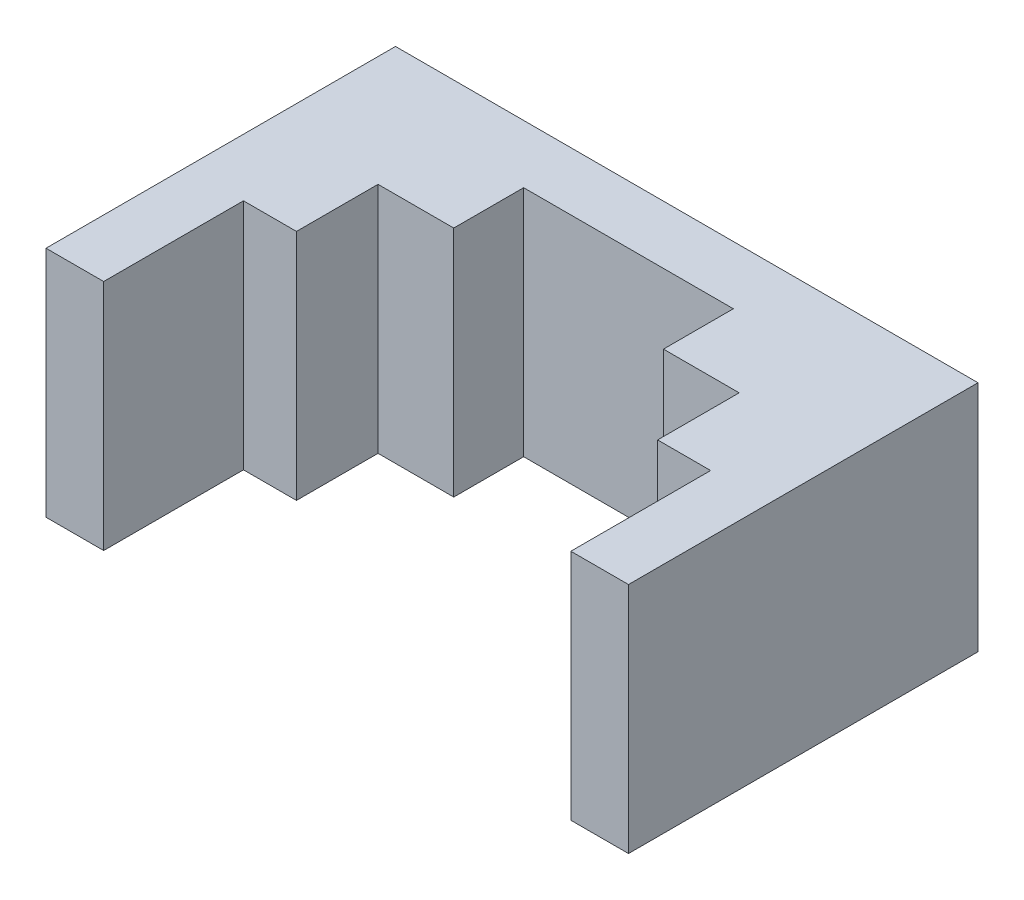
ISO-10303-21;
HEADER;
FILE_DESCRIPTION(('STEP AP214'),'2;1');
FILE_NAME('part.step','',(''),(''),'','','');
FILE_SCHEMA(('AUTOMOTIVE_DESIGN { 1 0 10303 214 1 1 1 1 }'));
ENDSEC;
DATA;
#1=APPLICATION_CONTEXT('core data for automotive mechanical design processes');
#2=APPLICATION_PROTOCOL_DEFINITION('international standard','automotive_design',2000,#1);
#3=PRODUCT_CONTEXT('',#1,'mechanical');
#4=PRODUCT('Part','Part','',(#3));
#5=PRODUCT_RELATED_PRODUCT_CATEGORY('part','',(#4));
#6=PRODUCT_DEFINITION_FORMATION('','',#4);
#7=PRODUCT_DEFINITION_CONTEXT('part definition',#1,'design');
#8=PRODUCT_DEFINITION('design','',#6,#7);
#9=PRODUCT_DEFINITION_SHAPE('','',#8);
#10=(LENGTH_UNIT() NAMED_UNIT(*) SI_UNIT(.MILLI.,.METRE.));
#11=(NAMED_UNIT(*) PLANE_ANGLE_UNIT() SI_UNIT($,.RADIAN.));
#12=(NAMED_UNIT(*) SI_UNIT($,.STERADIAN.) SOLID_ANGLE_UNIT());
#13=UNCERTAINTY_MEASURE_WITH_UNIT(LENGTH_MEASURE(1.E-05),#10,'distance_accuracy_value','');
#14=(GEOMETRIC_REPRESENTATION_CONTEXT(3) GLOBAL_UNCERTAINTY_ASSIGNED_CONTEXT((#13)) GLOBAL_UNIT_ASSIGNED_CONTEXT((#10,
#11,#12)) REPRESENTATION_CONTEXT('',''));
#15=CARTESIAN_POINT('',(0.,0.,0.));
#16=DIRECTION('',(0.,0.,1.));
#17=DIRECTION('',(1.,0.,0.));
#18=AXIS2_PLACEMENT_3D('',#15,#16,#17);
#19=CARTESIAN_POINT('',(4.5,5.,2.5));
#20=DIRECTION('',(1.,0.,0.));
#21=DIRECTION('',(0.,0.,-1.));
#22=AXIS2_PLACEMENT_3D('',#19,#20,#21);
#23=PLANE('',#22);
#24=DIRECTION('',(0.,-1.,0.));
#25=VECTOR('',#24,1.);
#26=CARTESIAN_POINT('',(4.5,5.,5.5));
#27=LINE('',#26,#25);
#28=CARTESIAN_POINT('',(4.5,5.,5.5));
#29=VERTEX_POINT('',#28);
#30=CARTESIAN_POINT('',(4.5,-5.,5.5));
#31=VERTEX_POINT('',#30);
#32=EDGE_CURVE('E177',#29,#31,#27,.T.);
#33=ORIENTED_EDGE('',*,*,#32,.F.);
#34=DIRECTION('',(0.,0.,1.));
#35=VECTOR('',#34,1.);
#36=CARTESIAN_POINT('',(4.5,5.,2.5));
#37=LINE('',#36,#35);
#38=CARTESIAN_POINT('',(4.5,5.,2.5));
#39=VERTEX_POINT('',#38);
#40=EDGE_CURVE('E167',#39,#29,#37,.T.);
#41=ORIENTED_EDGE('',*,*,#40,.F.);
#42=DIRECTION('',(0.,1.,0.));
#43=VECTOR('',#42,1.);
#44=CARTESIAN_POINT('',(4.5,5.,2.5));
#45=LINE('',#44,#43);
#46=CARTESIAN_POINT('',(4.5,-5.,2.5));
#47=VERTEX_POINT('',#46);
#48=EDGE_CURVE('E183',#47,#39,#45,.T.);
#49=ORIENTED_EDGE('',*,*,#48,.F.);
#50=DIRECTION('',(0.,0.,1.));
#51=VECTOR('',#50,1.);
#52=CARTESIAN_POINT('',(4.5,-5.,2.5));
#53=LINE('',#52,#51);
#54=EDGE_CURVE('E195',#47,#31,#53,.T.);
#55=ORIENTED_EDGE('',*,*,#54,.T.);
#56=EDGE_LOOP('',(#33,#41,#49,#55));
#57=FACE_BOUND('',#56,.T.);
#58=ADVANCED_FACE('F33',(#57),#23,.F.);
#59=CARTESIAN_POINT('',(-4.5,5.,2.5));
#60=DIRECTION('',(-1.,0.,0.));
#61=DIRECTION('',(0.,0.,1.));
#62=AXIS2_PLACEMENT_3D('',#59,#60,#61);
#63=PLANE('',#62);
#64=DIRECTION('',(0.,1.,0.));
#65=VECTOR('',#64,1.);
#66=CARTESIAN_POINT('',(-4.5,5.,5.5));
#67=LINE('',#66,#65);
#68=CARTESIAN_POINT('',(-4.5,-5.,5.5));
#69=VERTEX_POINT('',#68);
#70=CARTESIAN_POINT('',(-4.5,5.,5.5));
#71=VERTEX_POINT('',#70);
#72=EDGE_CURVE('E11',#69,#71,#67,.T.);
#73=ORIENTED_EDGE('',*,*,#72,.F.);
#74=DIRECTION('',(0.,0.,1.));
#75=VECTOR('',#74,1.);
#76=CARTESIAN_POINT('',(-4.5,-5.,2.5));
#77=LINE('',#76,#75);
#78=CARTESIAN_POINT('',(-4.5,-5.,2.5));
#79=VERTEX_POINT('',#78);
#80=EDGE_CURVE('E199',#79,#69,#77,.T.);
#81=ORIENTED_EDGE('',*,*,#80,.F.);
#82=DIRECTION('',(0.,-1.,0.));
#83=VECTOR('',#82,1.);
#84=CARTESIAN_POINT('',(-4.5,5.,2.5));
#85=LINE('',#84,#83);
#86=CARTESIAN_POINT('',(-4.5,5.,2.5));
#87=VERTEX_POINT('',#86);
#88=EDGE_CURVE('E189',#87,#79,#85,.T.);
#89=ORIENTED_EDGE('',*,*,#88,.F.);
#90=DIRECTION('',(0.,0.,1.));
#91=VECTOR('',#90,1.);
#92=CARTESIAN_POINT('',(-4.5,5.,2.5));
#93=LINE('',#92,#91);
#94=EDGE_CURVE('E202',#87,#71,#93,.T.);
#95=ORIENTED_EDGE('',*,*,#94,.T.);
#96=EDGE_LOOP('',(#73,#81,#89,#95));
#97=FACE_BOUND('',#96,.T.);
#98=ADVANCED_FACE('F301',(#97),#63,.F.);
#99=CARTESIAN_POINT('',(0.,0.,9.));
#100=DIRECTION('',(0.,0.,1.));
#101=DIRECTION('',(1.,0.,0.));
#102=AXIS2_PLACEMENT_3D('',#99,#100,#101);
#103=PLANE('',#102);
#104=DIRECTION('',(0.,1.,0.));
#105=VECTOR('',#104,1.);
#106=CARTESIAN_POINT('',(7.75,5.,9.));
#107=LINE('',#106,#105);
#108=CARTESIAN_POINT('',(7.75,-5.,9.));
#109=VERTEX_POINT('',#108);
#110=CARTESIAN_POINT('',(7.75,5.,9.));
#111=VERTEX_POINT('',#110);
#112=EDGE_CURVE('E152',#109,#111,#107,.T.);
#113=ORIENTED_EDGE('',*,*,#112,.F.);
#114=DIRECTION('',(1.,0.,0.));
#115=VECTOR('',#114,1.);
#116=CARTESIAN_POINT('',(-10.025,-5.,9.));
#117=LINE('',#116,#115);
#118=CARTESIAN_POINT('',(10.025,-5.,9.));
#119=VERTEX_POINT('',#118);
#120=EDGE_CURVE('E216',#109,#119,#117,.T.);
#121=ORIENTED_EDGE('',*,*,#120,.T.);
#122=DIRECTION('',(0.,1.,0.));
#123=VECTOR('',#122,1.);
#124=CARTESIAN_POINT('',(10.025,5.,9.));
#125=LINE('',#124,#123);
#126=CARTESIAN_POINT('',(10.025,5.,9.));
#127=VERTEX_POINT('',#126);
#128=EDGE_CURVE('E206',#119,#127,#125,.T.);
#129=ORIENTED_EDGE('',*,*,#128,.T.);
#130=DIRECTION('',(-1.,0.,0.));
#131=VECTOR('',#130,1.);
#132=CARTESIAN_POINT('',(-10.025,5.,9.));
#133=LINE('',#132,#131);
#134=EDGE_CURVE('E211',#127,#111,#133,.T.);
#135=ORIENTED_EDGE('',*,*,#134,.T.);
#136=EDGE_LOOP('',(#113,#121,#129,#135));
#137=FACE_BOUND('',#136,.T.);
#138=ADVANCED_FACE('F310',(#137),#103,.T.);
#139=CARTESIAN_POINT('',(0.,0.,15.));
#140=DIRECTION('',(0.,0.,1.));
#141=DIRECTION('',(1.,0.,0.));
#142=AXIS2_PLACEMENT_3D('',#139,#140,#141);
#143=PLANE('',#142);
#144=DIRECTION('',(0.,1.,0.));
#145=VECTOR('',#144,1.);
#146=CARTESIAN_POINT('',(10.025,5.,15.));
#147=LINE('',#146,#145);
#148=CARTESIAN_POINT('',(10.025,-5.,15.));
#149=VERTEX_POINT('',#148);
#150=CARTESIAN_POINT('',(10.025,5.,15.));
#151=VERTEX_POINT('',#150);
#152=EDGE_CURVE('E198',#149,#151,#147,.T.);
#153=ORIENTED_EDGE('',*,*,#152,.F.);
#154=DIRECTION('',(1.,0.,0.));
#155=VECTOR('',#154,1.);
#156=CARTESIAN_POINT('',(-12.5,-5.,15.));
#157=LINE('',#156,#155);
#158=CARTESIAN_POINT('',(12.5,-5.,15.));
#159=VERTEX_POINT('',#158);
#160=EDGE_CURVE('E243',#149,#159,#157,.T.);
#161=ORIENTED_EDGE('',*,*,#160,.T.);
#162=DIRECTION('',(0.,1.,0.));
#163=VECTOR('',#162,1.);
#164=CARTESIAN_POINT('',(12.5,5.,15.));
#165=LINE('',#164,#163);
#166=CARTESIAN_POINT('',(12.5,5.,15.));
#167=VERTEX_POINT('',#166);
#168=EDGE_CURVE('E233',#159,#167,#165,.T.);
#169=ORIENTED_EDGE('',*,*,#168,.T.);
#170=DIRECTION('',(-1.,0.,0.));
#171=VECTOR('',#170,1.);
#172=CARTESIAN_POINT('',(-12.5,5.,15.));
#173=LINE('',#172,#171);
#174=EDGE_CURVE('E238',#167,#151,#173,.T.);
#175=ORIENTED_EDGE('',*,*,#174,.T.);
#176=EDGE_LOOP('',(#153,#161,#169,#175));
#177=FACE_BOUND('',#176,.T.);
#178=ADVANCED_FACE('F315',(#177),#143,.T.);
#179=CARTESIAN_POINT('',(12.5,5.,15.));
#180=DIRECTION('',(-1.,0.,0.));
#181=DIRECTION('',(0.,-1.,0.));
#182=AXIS2_PLACEMENT_3D('',#179,#180,#181);
#183=PLANE('',#182);
#184=DIRECTION('',(0.,1.,0.));
#185=VECTOR('',#184,1.);
#186=CARTESIAN_POINT('',(12.5,5.,0.));
#187=LINE('',#186,#185);
#188=CARTESIAN_POINT('',(12.5,-5.,0.));
#189=VERTEX_POINT('',#188);
#190=CARTESIAN_POINT('',(12.5,5.,0.));
#191=VERTEX_POINT('',#190);
#192=EDGE_CURVE('E225',#189,#191,#187,.T.);
#193=ORIENTED_EDGE('',*,*,#192,.T.);
#194=DIRECTION('',(0.,0.,-1.));
#195=VECTOR('',#194,1.);
#196=CARTESIAN_POINT('',(12.5,5.,15.));
#197=LINE('',#196,#195);
#198=EDGE_CURVE('E41',#167,#191,#197,.T.);
#199=ORIENTED_EDGE('',*,*,#198,.F.);
#200=ORIENTED_EDGE('',*,*,#168,.F.);
#201=DIRECTION('',(0.,0.,-1.));
#202=VECTOR('',#201,1.);
#203=CARTESIAN_POINT('',(12.5,-5.,15.));
#204=LINE('',#203,#202);
#205=EDGE_CURVE('E247',#159,#189,#204,.T.);
#206=ORIENTED_EDGE('',*,*,#205,.T.);
#207=EDGE_LOOP('',(#193,#199,#200,#206));
#208=FACE_BOUND('',#207,.T.);
#209=ADVANCED_FACE('F35',(#208),#183,.F.);
#210=CARTESIAN_POINT('',(-12.5,5.,15.));
#211=DIRECTION('',(0.,-1.,0.));
#212=DIRECTION('',(0.,0.,-1.));
#213=AXIS2_PLACEMENT_3D('',#210,#211,#212);
#214=PLANE('',#213);
#215=DIRECTION('',(-1.,0.,0.));
#216=VECTOR('',#215,1.);
#217=CARTESIAN_POINT('',(-7.75,5.,5.5));
#218=LINE('',#217,#216);
#219=CARTESIAN_POINT('',(7.75,5.,5.5));
#220=VERTEX_POINT('',#219);
#221=EDGE_CURVE('E48',#220,#29,#218,.T.);
#222=ORIENTED_EDGE('',*,*,#221,.F.);
#223=DIRECTION('',(0.,0.,1.));
#224=VECTOR('',#223,1.);
#225=CARTESIAN_POINT('',(7.75,5.,5.5));
#226=LINE('',#225,#224);
#227=EDGE_CURVE('E147',#220,#111,#226,.T.);
#228=ORIENTED_EDGE('',*,*,#227,.T.);
#229=ORIENTED_EDGE('',*,*,#134,.F.);
#230=DIRECTION('',(0.,0.,1.));
#231=VECTOR('',#230,1.);
#232=CARTESIAN_POINT('',(10.025,5.,9.));
#233=LINE('',#232,#231);
#234=EDGE_CURVE('E220',#127,#151,#233,.T.);
#235=ORIENTED_EDGE('',*,*,#234,.T.);
#236=ORIENTED_EDGE('',*,*,#174,.F.);
#237=ORIENTED_EDGE('',*,*,#198,.T.);
#238=DIRECTION('',(-1.,0.,0.));
#239=VECTOR('',#238,1.);
#240=CARTESIAN_POINT('',(-12.5,5.,0.));
#241=LINE('',#240,#239);
#242=CARTESIAN_POINT('',(-12.5,5.,0.));
#243=VERTEX_POINT('',#242);
#244=EDGE_CURVE('E250',#191,#243,#241,.T.);
#245=ORIENTED_EDGE('',*,*,#244,.T.);
#246=DIRECTION('',(0.,0.,-1.));
#247=VECTOR('',#246,1.);
#248=CARTESIAN_POINT('',(-12.5,5.,15.));
#249=LINE('',#248,#247);
#250=CARTESIAN_POINT('',(-12.5,5.,15.));
#251=VERTEX_POINT('',#250);
#252=EDGE_CURVE('E260',#251,#243,#249,.T.);
#253=ORIENTED_EDGE('',*,*,#252,.F.);
#254=CARTESIAN_POINT('',(-10.025,5.,15.));
#255=VERTEX_POINT('',#254);
#256=EDGE_CURVE('E236',#255,#251,#173,.T.);
#257=ORIENTED_EDGE('',*,*,#256,.F.);
#258=DIRECTION('',(0.,0.,1.));
#259=VECTOR('',#258,1.);
#260=CARTESIAN_POINT('',(-10.025,5.,9.));
#261=LINE('',#260,#259);
#262=CARTESIAN_POINT('',(-10.025,5.,9.));
#263=VERTEX_POINT('',#262);
#264=EDGE_CURVE('E229',#263,#255,#261,.T.);
#265=ORIENTED_EDGE('',*,*,#264,.F.);
#266=CARTESIAN_POINT('',(-7.75,5.,9.));
#267=VERTEX_POINT('',#266);
#268=EDGE_CURVE('E209',#267,#263,#133,.T.);
#269=ORIENTED_EDGE('',*,*,#268,.F.);
#270=DIRECTION('',(0.,0.,1.));
#271=VECTOR('',#270,1.);
#272=CARTESIAN_POINT('',(-7.75,5.,5.5));
#273=LINE('',#272,#271);
#274=CARTESIAN_POINT('',(-7.75,5.,5.5));
#275=VERTEX_POINT('',#274);
#276=EDGE_CURVE('E156',#275,#267,#273,.T.);
#277=ORIENTED_EDGE('',*,*,#276,.F.);
#278=EDGE_CURVE('E161',#71,#275,#218,.T.);
#279=ORIENTED_EDGE('',*,*,#278,.F.);
#280=ORIENTED_EDGE('',*,*,#94,.F.);
#281=DIRECTION('',(-1.,0.,0.));
#282=VECTOR('',#281,1.);
#283=CARTESIAN_POINT('',(-4.5,5.,2.5));
#284=LINE('',#283,#282);
#285=EDGE_CURVE('E186',#39,#87,#284,.T.);
#286=ORIENTED_EDGE('',*,*,#285,.F.);
#287=ORIENTED_EDGE('',*,*,#40,.T.);
#288=EDGE_LOOP('',(#222,#228,#229,#235,#236,#237,#245,#253,#257,#265,#269,#277,#279,#280,#286,#287));
#289=FACE_BOUND('',#288,.T.);
#290=ADVANCED_FACE('F165',(#289),#214,.F.);
#291=CARTESIAN_POINT('',(-12.5,5.,15.));
#292=DIRECTION('',(1.,0.,0.));
#293=DIRECTION('',(0.,1.,0.));
#294=AXIS2_PLACEMENT_3D('',#291,#292,#293);
#295=PLANE('',#294);
#296=DIRECTION('',(0.,-1.,0.));
#297=VECTOR('',#296,1.);
#298=CARTESIAN_POINT('',(-12.5,5.,0.));
#299=LINE('',#298,#297);
#300=CARTESIAN_POINT('',(-12.5,-5.,0.));
#301=VERTEX_POINT('',#300);
#302=EDGE_CURVE('E252',#243,#301,#299,.T.);
#303=ORIENTED_EDGE('',*,*,#302,.T.);
#304=DIRECTION('',(0.,0.,-1.));
#305=VECTOR('',#304,1.);
#306=CARTESIAN_POINT('',(-12.5,-5.,15.));
#307=LINE('',#306,#305);
#308=CARTESIAN_POINT('',(-12.5,-5.,15.));
#309=VERTEX_POINT('',#308);
#310=EDGE_CURVE('E257',#309,#301,#307,.T.);
#311=ORIENTED_EDGE('',*,*,#310,.F.);
#312=DIRECTION('',(0.,-1.,0.));
#313=VECTOR('',#312,1.);
#314=CARTESIAN_POINT('',(-12.5,5.,15.));
#315=LINE('',#314,#313);
#316=EDGE_CURVE('E241',#251,#309,#315,.T.);
#317=ORIENTED_EDGE('',*,*,#316,.F.);
#318=ORIENTED_EDGE('',*,*,#252,.T.);
#319=EDGE_LOOP('',(#303,#311,#317,#318));
#320=FACE_BOUND('',#319,.T.);
#321=ADVANCED_FACE('F275',(#320),#295,.F.);
#322=CARTESIAN_POINT('',(-12.5,-5.,15.));
#323=DIRECTION('',(0.,1.,0.));
#324=DIRECTION('',(0.,0.,1.));
#325=AXIS2_PLACEMENT_3D('',#322,#323,#324);
#326=PLANE('',#325);
#327=DIRECTION('',(1.,0.,0.));
#328=VECTOR('',#327,1.);
#329=CARTESIAN_POINT('',(-7.75,-5.,5.5));
#330=LINE('',#329,#328);
#331=CARTESIAN_POINT('',(-7.75,-5.,5.5));
#332=VERTEX_POINT('',#331);
#333=EDGE_CURVE('E55',#332,#69,#330,.T.);
#334=ORIENTED_EDGE('',*,*,#333,.F.);
#335=DIRECTION('',(0.,0.,1.));
#336=VECTOR('',#335,1.);
#337=CARTESIAN_POINT('',(-7.75,-5.,5.5));
#338=LINE('',#337,#336);
#339=CARTESIAN_POINT('',(-7.75,-5.,9.));
#340=VERTEX_POINT('',#339);
#341=EDGE_CURVE('E178',#332,#340,#338,.T.);
#342=ORIENTED_EDGE('',*,*,#341,.T.);
#343=CARTESIAN_POINT('',(-10.025,-5.,9.));
#344=VERTEX_POINT('',#343);
#345=EDGE_CURVE('E217',#344,#340,#117,.T.);
#346=ORIENTED_EDGE('',*,*,#345,.F.);
#347=DIRECTION('',(0.,0.,1.));
#348=VECTOR('',#347,1.);
#349=CARTESIAN_POINT('',(-10.025,-5.,9.));
#350=LINE('',#349,#348);
#351=CARTESIAN_POINT('',(-10.025,-5.,15.));
#352=VERTEX_POINT('',#351);
#353=EDGE_CURVE('E226',#344,#352,#350,.T.);
#354=ORIENTED_EDGE('',*,*,#353,.T.);
#355=EDGE_CURVE('E244',#309,#352,#157,.T.);
#356=ORIENTED_EDGE('',*,*,#355,.F.);
#357=ORIENTED_EDGE('',*,*,#310,.T.);
#358=DIRECTION('',(1.,0.,0.));
#359=VECTOR('',#358,1.);
#360=CARTESIAN_POINT('',(-12.5,-5.,0.));
#361=LINE('',#360,#359);
#362=EDGE_CURVE('E237',#301,#189,#361,.T.);
#363=ORIENTED_EDGE('',*,*,#362,.T.);
#364=ORIENTED_EDGE('',*,*,#205,.F.);
#365=ORIENTED_EDGE('',*,*,#160,.F.);
#366=DIRECTION('',(0.,0.,1.));
#367=VECTOR('',#366,1.);
#368=CARTESIAN_POINT('',(10.025,-5.,9.));
#369=LINE('',#368,#367);
#370=EDGE_CURVE('E223',#119,#149,#369,.T.);
#371=ORIENTED_EDGE('',*,*,#370,.F.);
#372=ORIENTED_EDGE('',*,*,#120,.F.);
#373=DIRECTION('',(0.,0.,1.));
#374=VECTOR('',#373,1.);
#375=CARTESIAN_POINT('',(7.75,-5.,5.5));
#376=LINE('',#375,#374);
#377=CARTESIAN_POINT('',(7.75,-5.,5.5));
#378=VERTEX_POINT('',#377);
#379=EDGE_CURVE('E175',#378,#109,#376,.T.);
#380=ORIENTED_EDGE('',*,*,#379,.F.);
#381=EDGE_CURVE('E160',#31,#378,#330,.T.);
#382=ORIENTED_EDGE('',*,*,#381,.F.);
#383=ORIENTED_EDGE('',*,*,#54,.F.);
#384=DIRECTION('',(1.,0.,0.));
#385=VECTOR('',#384,1.);
#386=CARTESIAN_POINT('',(-4.5,-5.,2.5));
#387=LINE('',#386,#385);
#388=EDGE_CURVE('E192',#79,#47,#387,.T.);
#389=ORIENTED_EDGE('',*,*,#388,.F.);
#390=ORIENTED_EDGE('',*,*,#80,.T.);
#391=EDGE_LOOP('',(#334,#342,#346,#354,#356,#357,#363,#364,#365,#371,#372,#380,#382,#383,#389,#390));
#392=FACE_BOUND('',#391,.T.);
#393=ADVANCED_FACE('F279',(#392),#326,.F.);
#394=DIRECTION('',(0.,-1.,0.));
#395=VECTOR('',#394,1.);
#396=CARTESIAN_POINT('',(-10.025,5.,15.));
#397=LINE('',#396,#395);
#398=EDGE_CURVE('E210',#255,#352,#397,.T.);
#399=ORIENTED_EDGE('',*,*,#398,.F.);
#400=ORIENTED_EDGE('',*,*,#256,.T.);
#401=ORIENTED_EDGE('',*,*,#316,.T.);
#402=ORIENTED_EDGE('',*,*,#355,.T.);
#403=EDGE_LOOP('',(#399,#400,#401,#402));
#404=FACE_BOUND('',#403,.T.);
#405=ADVANCED_FACE('F283',(#404),#143,.T.);
#406=CARTESIAN_POINT('',(0.,0.,0.));
#407=DIRECTION('',(0.,0.,1.));
#408=DIRECTION('',(1.,0.,0.));
#409=AXIS2_PLACEMENT_3D('',#406,#407,#408);
#410=PLANE('',#409);
#411=ORIENTED_EDGE('',*,*,#192,.F.);
#412=ORIENTED_EDGE('',*,*,#362,.F.);
#413=ORIENTED_EDGE('',*,*,#302,.F.);
#414=ORIENTED_EDGE('',*,*,#244,.F.);
#415=EDGE_LOOP('',(#411,#412,#413,#414));
#416=FACE_BOUND('',#415,.T.);
#417=ADVANCED_FACE('F271',(#416),#410,.F.);
#418=CARTESIAN_POINT('',(10.025,5.,9.));
#419=DIRECTION('',(1.,0.,0.));
#420=DIRECTION('',(0.,0.,-1.));
#421=AXIS2_PLACEMENT_3D('',#418,#419,#420);
#422=PLANE('',#421);
#423=ORIENTED_EDGE('',*,*,#152,.T.);
#424=ORIENTED_EDGE('',*,*,#234,.F.);
#425=ORIENTED_EDGE('',*,*,#128,.F.);
#426=ORIENTED_EDGE('',*,*,#370,.T.);
#427=EDGE_LOOP('',(#423,#424,#425,#426));
#428=FACE_BOUND('',#427,.T.);
#429=ADVANCED_FACE('F317',(#428),#422,.F.);
#430=CARTESIAN_POINT('',(-10.025,5.,9.));
#431=DIRECTION('',(-1.,0.,0.));
#432=DIRECTION('',(0.,0.,1.));
#433=AXIS2_PLACEMENT_3D('',#430,#431,#432);
#434=PLANE('',#433);
#435=ORIENTED_EDGE('',*,*,#398,.T.);
#436=ORIENTED_EDGE('',*,*,#353,.F.);
#437=DIRECTION('',(0.,-1.,0.));
#438=VECTOR('',#437,1.);
#439=CARTESIAN_POINT('',(-10.025,5.,9.));
#440=LINE('',#439,#438);
#441=EDGE_CURVE('E213',#263,#344,#440,.T.);
#442=ORIENTED_EDGE('',*,*,#441,.F.);
#443=ORIENTED_EDGE('',*,*,#264,.T.);
#444=EDGE_LOOP('',(#435,#436,#442,#443));
#445=FACE_BOUND('',#444,.T.);
#446=ADVANCED_FACE('F290',(#445),#434,.F.);
#447=DIRECTION('',(0.,-1.,0.));
#448=VECTOR('',#447,1.);
#449=CARTESIAN_POINT('',(-7.75,5.,9.));
#450=LINE('',#449,#448);
#451=EDGE_CURVE('E162',#267,#340,#450,.T.);
#452=ORIENTED_EDGE('',*,*,#451,.F.);
#453=ORIENTED_EDGE('',*,*,#268,.T.);
#454=ORIENTED_EDGE('',*,*,#441,.T.);
#455=ORIENTED_EDGE('',*,*,#345,.T.);
#456=EDGE_LOOP('',(#452,#453,#454,#455));
#457=FACE_BOUND('',#456,.T.);
#458=ADVANCED_FACE('F293',(#457),#103,.T.);
#459=CARTESIAN_POINT('',(0.,0.,2.5));
#460=DIRECTION('',(0.,0.,1.));
#461=DIRECTION('',(1.,0.,0.));
#462=AXIS2_PLACEMENT_3D('',#459,#460,#461);
#463=PLANE('',#462);
#464=ORIENTED_EDGE('',*,*,#48,.T.);
#465=ORIENTED_EDGE('',*,*,#285,.T.);
#466=ORIENTED_EDGE('',*,*,#88,.T.);
#467=ORIENTED_EDGE('',*,*,#388,.T.);
#468=EDGE_LOOP('',(#464,#465,#466,#467));
#469=FACE_BOUND('',#468,.T.);
#470=ADVANCED_FACE('F304',(#469),#463,.T.);
#471=CARTESIAN_POINT('',(0.,0.,5.5));
#472=DIRECTION('',(0.,0.,1.));
#473=DIRECTION('',(1.,0.,0.));
#474=AXIS2_PLACEMENT_3D('',#471,#472,#473);
#475=PLANE('',#474);
#476=ORIENTED_EDGE('',*,*,#72,.T.);
#477=ORIENTED_EDGE('',*,*,#278,.T.);
#478=DIRECTION('',(0.,-1.,0.));
#479=VECTOR('',#478,1.);
#480=CARTESIAN_POINT('',(-7.75,5.,5.5));
#481=LINE('',#480,#479);
#482=EDGE_CURVE('E168',#275,#332,#481,.T.);
#483=ORIENTED_EDGE('',*,*,#482,.T.);
#484=ORIENTED_EDGE('',*,*,#333,.T.);
#485=EDGE_LOOP('',(#476,#477,#483,#484));
#486=FACE_BOUND('',#485,.T.);
#487=ADVANCED_FACE('F297',(#486),#475,.T.);
#488=CARTESIAN_POINT('',(-7.75,5.,5.5));
#489=DIRECTION('',(-1.,0.,0.));
#490=DIRECTION('',(0.,0.,1.));
#491=AXIS2_PLACEMENT_3D('',#488,#489,#490);
#492=PLANE('',#491);
#493=ORIENTED_EDGE('',*,*,#451,.T.);
#494=ORIENTED_EDGE('',*,*,#341,.F.);
#495=ORIENTED_EDGE('',*,*,#482,.F.);
#496=ORIENTED_EDGE('',*,*,#276,.T.);
#497=EDGE_LOOP('',(#493,#494,#495,#496));
#498=FACE_BOUND('',#497,.T.);
#499=ADVANCED_FACE('F296',(#498),#492,.F.);
#500=ORIENTED_EDGE('',*,*,#32,.T.);
#501=ORIENTED_EDGE('',*,*,#381,.T.);
#502=DIRECTION('',(0.,1.,0.));
#503=VECTOR('',#502,1.);
#504=CARTESIAN_POINT('',(7.75,5.,5.5));
#505=LINE('',#504,#503);
#506=EDGE_CURVE('E149',#378,#220,#505,.T.);
#507=ORIENTED_EDGE('',*,*,#506,.T.);
#508=ORIENTED_EDGE('',*,*,#221,.T.);
#509=EDGE_LOOP('',(#500,#501,#507,#508));
#510=FACE_BOUND('',#509,.T.);
#511=ADVANCED_FACE('F158',(#510),#475,.T.);
#512=CARTESIAN_POINT('',(7.75,5.,5.5));
#513=DIRECTION('',(1.,0.,0.));
#514=DIRECTION('',(0.,0.,-1.));
#515=AXIS2_PLACEMENT_3D('',#512,#513,#514);
#516=PLANE('',#515);
#517=ORIENTED_EDGE('',*,*,#112,.T.);
#518=ORIENTED_EDGE('',*,*,#227,.F.);
#519=ORIENTED_EDGE('',*,*,#506,.F.);
#520=ORIENTED_EDGE('',*,*,#379,.T.);
#521=EDGE_LOOP('',(#517,#518,#519,#520));
#522=FACE_BOUND('',#521,.T.);
#523=ADVANCED_FACE('F148',(#522),#516,.F.);
#524=CLOSED_SHELL('',(#58,#98,#138,#178,#209,#290,#321,#393,#405,#417,#429,#446,#458,#470,#487,
#499,#511,#523));
#525=MANIFOLD_SOLID_BREP('B2',#524);
#526=ADVANCED_BREP_SHAPE_REPRESENTATION('',(#18,#525),#14);
#527=SHAPE_DEFINITION_REPRESENTATION(#9,#526);
ENDSEC;
END-ISO-10303-21;
